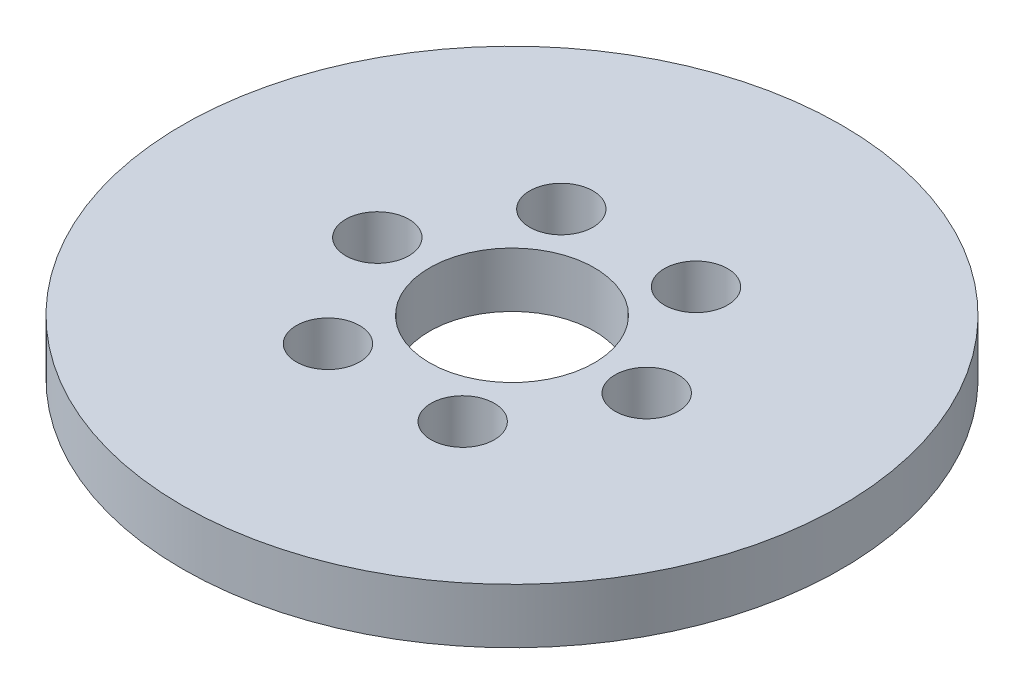
ISO-10303-21;
HEADER;
FILE_DESCRIPTION(('STEP AP214'),'2;1');
FILE_NAME('part.step','',(''),(''),'','','');
FILE_SCHEMA(('AUTOMOTIVE_DESIGN { 1 0 10303 214 1 1 1 1 }'));
ENDSEC;
DATA;
#1=APPLICATION_CONTEXT('core data for automotive mechanical design processes');
#2=APPLICATION_PROTOCOL_DEFINITION('international standard','automotive_design',2000,#1);
#3=PRODUCT_CONTEXT('',#1,'mechanical');
#4=PRODUCT('Part','Part','',(#3));
#5=PRODUCT_RELATED_PRODUCT_CATEGORY('part','',(#4));
#6=PRODUCT_DEFINITION_FORMATION('','',#4);
#7=PRODUCT_DEFINITION_CONTEXT('part definition',#1,'design');
#8=PRODUCT_DEFINITION('design','',#6,#7);
#9=PRODUCT_DEFINITION_SHAPE('','',#8);
#10=(LENGTH_UNIT() NAMED_UNIT(*) SI_UNIT(.MILLI.,.METRE.));
#11=(NAMED_UNIT(*) PLANE_ANGLE_UNIT() SI_UNIT($,.RADIAN.));
#12=(NAMED_UNIT(*) SI_UNIT($,.STERADIAN.) SOLID_ANGLE_UNIT());
#13=UNCERTAINTY_MEASURE_WITH_UNIT(LENGTH_MEASURE(1.E-05),#10,'distance_accuracy_value','');
#14=(GEOMETRIC_REPRESENTATION_CONTEXT(3) GLOBAL_UNCERTAINTY_ASSIGNED_CONTEXT((#13)) GLOBAL_UNIT_ASSIGNED_CONTEXT((#10,
#11,#12)) REPRESENTATION_CONTEXT('',''));
#15=CARTESIAN_POINT('',(0.,0.,0.));
#16=DIRECTION('',(0.,0.,1.));
#17=DIRECTION('',(1.,0.,0.));
#18=AXIS2_PLACEMENT_3D('',#15,#16,#17);
#19=CARTESIAN_POINT('',(0.,10.,0.));
#20=DIRECTION('',(0.,-1.,0.));
#21=DIRECTION('',(0.,0.,-1.));
#22=AXIS2_PLACEMENT_3D('',#19,#20,#21);
#23=CYLINDRICAL_SURFACE('',#22,60.);
#24=CARTESIAN_POINT('',(0.,10.,0.));
#25=DIRECTION('',(0.,1.,0.));
#26=DIRECTION('',(0.,0.,1.));
#27=AXIS2_PLACEMENT_3D('',#24,#25,#26);
#28=CIRCLE('',#27,60.);
#29=CARTESIAN_POINT('',(0.,10.,60.));
#30=VERTEX_POINT('',#29);
#31=EDGE_CURVE('E10',#30,#30,#28,.T.);
#32=ORIENTED_EDGE('',*,*,#31,.F.);
#33=EDGE_LOOP('',(#32));
#34=FACE_BOUND('',#33,.T.);
#35=CARTESIAN_POINT('',(0.,0.,0.));
#36=DIRECTION('',(0.,1.,0.));
#37=DIRECTION('',(0.,0.,1.));
#38=AXIS2_PLACEMENT_3D('',#35,#36,#37);
#39=CIRCLE('',#38,60.);
#40=CARTESIAN_POINT('',(0.,0.,60.));
#41=VERTEX_POINT('',#40);
#42=EDGE_CURVE('E37',#41,#41,#39,.T.);
#43=ORIENTED_EDGE('',*,*,#42,.T.);
#44=EDGE_LOOP('',(#43));
#45=FACE_BOUND('',#44,.T.);
#46=ADVANCED_FACE('F40',(#34,#45),#23,.T.);
#47=CARTESIAN_POINT('',(0.,10.,0.));
#48=DIRECTION('',(0.,1.,0.));
#49=DIRECTION('',(0.,0.,1.));
#50=AXIS2_PLACEMENT_3D('',#47,#48,#49);
#51=PLANE('',#50);
#52=CARTESIAN_POINT('',(-12.262471475754,10.,-21.2392236223694));
#53=DIRECTION('',(0.,1.,0.));
#54=DIRECTION('',(-0.866025403784433,0.,0.50000000000001));
#55=AXIS2_PLACEMENT_3D('',#52,#53,#54);
#56=CIRCLE('',#55,5.75771066863464);
#57=CARTESIAN_POINT('',(-17.2487951824322,10.,-18.360368288052));
#58=VERTEX_POINT('',#57);
#59=EDGE_CURVE('E70',#58,#58,#56,.T.);
#60=ORIENTED_EDGE('',*,*,#59,.F.);
#61=EDGE_LOOP('',(#60));
#62=FACE_BOUND('',#61,.T.);
#63=CARTESIAN_POINT('',(12.2624714757535,10.,-21.2392236223697));
#64=DIRECTION('',(0.,1.,0.));
#65=DIRECTION('',(-0.866025403784443,0.,-0.499999999999992));
#66=AXIS2_PLACEMENT_3D('',#63,#64,#65);
#67=CIRCLE('',#66,5.75771066863464);
#68=CARTESIAN_POINT('',(7.27614776907521,10.,-24.1180789566869));
#69=VERTEX_POINT('',#68);
#70=EDGE_CURVE('E71',#69,#69,#67,.T.);
#71=ORIENTED_EDGE('',*,*,#70,.F.);
#72=EDGE_LOOP('',(#71));
#73=FACE_BOUND('',#72,.T.);
#74=CARTESIAN_POINT('',(24.5249429515074,10.,0.));
#75=DIRECTION('',(0.,1.,0.));
#76=DIRECTION('',(0.,0.,-1.));
#77=AXIS2_PLACEMENT_3D('',#74,#75,#76);
#78=CIRCLE('',#77,5.75771066863464);
#79=CARTESIAN_POINT('',(24.5249429515074,10.,-5.75771066863464));
#80=VERTEX_POINT('',#79);
#81=EDGE_CURVE('E78',#80,#80,#78,.T.);
#82=ORIENTED_EDGE('',*,*,#81,.F.);
#83=EDGE_LOOP('',(#82));
#84=FACE_BOUND('',#83,.T.);
#85=CARTESIAN_POINT('',(12.2624714757538,10.,21.2392236223695));
#86=DIRECTION('',(0.,1.,0.));
#87=DIRECTION('',(0.866025403784436,0.,-0.500000000000004));
#88=AXIS2_PLACEMENT_3D('',#85,#86,#87);
#89=CIRCLE('',#88,5.75771066863464);
#90=CARTESIAN_POINT('',(17.2487951824321,10.,18.3603682880521));
#91=VERTEX_POINT('',#90);
#92=EDGE_CURVE('E84',#91,#91,#89,.T.);
#93=ORIENTED_EDGE('',*,*,#92,.F.);
#94=EDGE_LOOP('',(#93));
#95=FACE_BOUND('',#94,.T.);
#96=CARTESIAN_POINT('',(-12.2624714757537,10.,21.2392236223696));
#97=DIRECTION('',(0.,1.,0.));
#98=DIRECTION('',(0.86602540378444,0.,0.499999999999998));
#99=AXIS2_PLACEMENT_3D('',#96,#97,#98);
#100=CIRCLE('',#99,5.75771066863464);
#101=CARTESIAN_POINT('',(-7.27614776907538,10.,24.1180789566869));
#102=VERTEX_POINT('',#101);
#103=EDGE_CURVE('E61',#102,#102,#100,.T.);
#104=ORIENTED_EDGE('',*,*,#103,.F.);
#105=EDGE_LOOP('',(#104));
#106=FACE_BOUND('',#105,.T.);
#107=CARTESIAN_POINT('',(-24.5249429515074,10.,0.));
#108=DIRECTION('',(0.,1.,0.));
#109=DIRECTION('',(0.,0.,1.));
#110=AXIS2_PLACEMENT_3D('',#107,#108,#109);
#111=CIRCLE('',#110,5.75771066863464);
#112=CARTESIAN_POINT('',(-24.5249429515074,10.,5.75771066863464));
#113=VERTEX_POINT('',#112);
#114=EDGE_CURVE('E54',#113,#113,#111,.T.);
#115=ORIENTED_EDGE('',*,*,#114,.F.);
#116=EDGE_LOOP('',(#115));
#117=FACE_BOUND('',#116,.T.);
#118=CARTESIAN_POINT('',(0.,10.,0.));
#119=DIRECTION('',(0.,1.,0.));
#120=DIRECTION('',(0.,0.,1.));
#121=AXIS2_PLACEMENT_3D('',#118,#119,#120);
#122=CIRCLE('',#121,15.);
#123=CARTESIAN_POINT('',(0.,10.,15.));
#124=VERTEX_POINT('',#123);
#125=EDGE_CURVE('E50',#124,#124,#122,.T.);
#126=ORIENTED_EDGE('',*,*,#125,.F.);
#127=EDGE_LOOP('',(#126));
#128=FACE_BOUND('',#127,.T.);
#129=ORIENTED_EDGE('',*,*,#31,.T.);
#130=EDGE_LOOP('',(#129));
#131=FACE_BOUND('',#130,.T.);
#132=ADVANCED_FACE('F99',(#62,#73,#84,#95,#106,#117,#128,#131),#51,.T.);
#133=CARTESIAN_POINT('',(0.,0.,0.));
#134=DIRECTION('',(0.,1.,0.));
#135=DIRECTION('',(0.,0.,1.));
#136=AXIS2_PLACEMENT_3D('',#133,#134,#135);
#137=PLANE('',#136);
#138=CARTESIAN_POINT('',(0.,0.,0.));
#139=DIRECTION('',(0.,1.,0.));
#140=DIRECTION('',(0.,0.,1.));
#141=AXIS2_PLACEMENT_3D('',#138,#139,#140);
#142=CIRCLE('',#141,15.);
#143=CARTESIAN_POINT('',(0.,0.,15.));
#144=VERTEX_POINT('',#143);
#145=EDGE_CURVE('E47',#144,#144,#142,.T.);
#146=ORIENTED_EDGE('',*,*,#145,.T.);
#147=EDGE_LOOP('',(#146));
#148=FACE_BOUND('',#147,.T.);
#149=ORIENTED_EDGE('',*,*,#42,.F.);
#150=EDGE_LOOP('',(#149));
#151=FACE_BOUND('',#150,.T.);
#152=ADVANCED_FACE('F103',(#148,#151),#137,.F.);
#153=CARTESIAN_POINT('',(0.,10.,0.));
#154=DIRECTION('',(0.,-1.,0.));
#155=DIRECTION('',(0.,0.,-1.));
#156=AXIS2_PLACEMENT_3D('',#153,#154,#155);
#157=CYLINDRICAL_SURFACE('',#156,15.);
#158=ORIENTED_EDGE('',*,*,#125,.T.);
#159=EDGE_LOOP('',(#158));
#160=FACE_BOUND('',#159,.T.);
#161=ORIENTED_EDGE('',*,*,#145,.F.);
#162=EDGE_LOOP('',(#161));
#163=FACE_BOUND('',#162,.T.);
#164=ADVANCED_FACE('F115',(#160,#163),#157,.F.);
#165=CARTESIAN_POINT('',(-24.5249429515074,1.22633793782889,0.));
#166=DIRECTION('',(0.,1.,0.));
#167=DIRECTION('',(0.,0.,1.));
#168=AXIS2_PLACEMENT_3D('',#165,#166,#167);
#169=CYLINDRICAL_SURFACE('',#168,5.75771066863464);
#170=CARTESIAN_POINT('',(-24.5249429515074,1.22633793782889,0.));
#171=DIRECTION('',(0.,1.,0.));
#172=DIRECTION('',(0.,0.,1.));
#173=AXIS2_PLACEMENT_3D('',#170,#171,#172);
#174=CIRCLE('',#173,5.75771066863464);
#175=CARTESIAN_POINT('',(-24.5249429515074,1.22633793782889,5.75771066863464));
#176=VERTEX_POINT('',#175);
#177=EDGE_CURVE('E55',#176,#176,#174,.T.);
#178=ORIENTED_EDGE('',*,*,#177,.F.);
#179=EDGE_LOOP('',(#178));
#180=FACE_BOUND('',#179,.T.);
#181=ORIENTED_EDGE('',*,*,#114,.T.);
#182=EDGE_LOOP('',(#181));
#183=FACE_BOUND('',#182,.T.);
#184=ADVANCED_FACE('F113',(#180,#183),#169,.F.);
#185=CARTESIAN_POINT('',(-24.5249429515074,1.22633793782889,0.));
#186=DIRECTION('',(0.,1.,0.));
#187=DIRECTION('',(0.,0.,1.));
#188=AXIS2_PLACEMENT_3D('',#185,#186,#187);
#189=PLANE('',#188);
#190=ORIENTED_EDGE('',*,*,#177,.T.);
#191=EDGE_LOOP('',(#190));
#192=FACE_BOUND('',#191,.T.);
#193=ADVANCED_FACE('F144',(#192),#189,.T.);
#194=CARTESIAN_POINT('',(-12.2624714757537,1.22633793782889,21.2392236223696));
#195=DIRECTION('',(0.,1.,0.));
#196=DIRECTION('',(0.,0.,1.));
#197=AXIS2_PLACEMENT_3D('',#194,#195,#196);
#198=CYLINDRICAL_SURFACE('',#197,5.75771066863464);
#199=CARTESIAN_POINT('',(-12.2624714757537,1.22633793782889,21.2392236223696));
#200=DIRECTION('',(0.,1.,0.));
#201=DIRECTION('',(0.86602540378444,0.,0.499999999999998));
#202=AXIS2_PLACEMENT_3D('',#199,#200,#201);
#203=CIRCLE('',#202,5.75771066863464);
#204=CARTESIAN_POINT('',(-7.27614776907538,1.22633793782889,24.1180789566869));
#205=VERTEX_POINT('',#204);
#206=EDGE_CURVE('E59',#205,#205,#203,.T.);
#207=ORIENTED_EDGE('',*,*,#206,.F.);
#208=EDGE_LOOP('',(#207));
#209=FACE_BOUND('',#208,.T.);
#210=ORIENTED_EDGE('',*,*,#103,.T.);
#211=EDGE_LOOP('',(#210));
#212=FACE_BOUND('',#211,.T.);
#213=ADVANCED_FACE('F153',(#209,#212),#198,.F.);
#214=CARTESIAN_POINT('',(-12.2624714757537,1.22633793782889,21.2392236223696));
#215=DIRECTION('',(0.,1.,0.));
#216=DIRECTION('',(0.86602540378444,0.,0.499999999999998));
#217=AXIS2_PLACEMENT_3D('',#214,#215,#216);
#218=PLANE('',#217);
#219=ORIENTED_EDGE('',*,*,#206,.T.);
#220=EDGE_LOOP('',(#219));
#221=FACE_BOUND('',#220,.T.);
#222=ADVANCED_FACE('F96',(#221),#218,.T.);
#223=CARTESIAN_POINT('',(12.2624714757538,1.22633793782889,21.2392236223695));
#224=DIRECTION('',(0.,1.,0.));
#225=DIRECTION('',(0.,0.,1.));
#226=AXIS2_PLACEMENT_3D('',#223,#224,#225);
#227=CYLINDRICAL_SURFACE('',#226,5.75771066863464);
#228=CARTESIAN_POINT('',(12.2624714757538,1.22633793782889,21.2392236223695));
#229=DIRECTION('',(0.,1.,0.));
#230=DIRECTION('',(0.866025403784436,0.,-0.500000000000004));
#231=AXIS2_PLACEMENT_3D('',#228,#229,#230);
#232=CIRCLE('',#231,5.75771066863464);
#233=CARTESIAN_POINT('',(17.2487951824321,1.22633793782889,18.3603682880521));
#234=VERTEX_POINT('',#233);
#235=EDGE_CURVE('E63',#234,#234,#232,.T.);
#236=ORIENTED_EDGE('',*,*,#235,.F.);
#237=EDGE_LOOP('',(#236));
#238=FACE_BOUND('',#237,.T.);
#239=ORIENTED_EDGE('',*,*,#92,.T.);
#240=EDGE_LOOP('',(#239));
#241=FACE_BOUND('',#240,.T.);
#242=ADVANCED_FACE('F91',(#238,#241),#227,.F.);
#243=CARTESIAN_POINT('',(12.2624714757538,1.22633793782889,21.2392236223695));
#244=DIRECTION('',(0.,1.,0.));
#245=DIRECTION('',(0.866025403784436,0.,-0.500000000000004));
#246=AXIS2_PLACEMENT_3D('',#243,#244,#245);
#247=PLANE('',#246);
#248=ORIENTED_EDGE('',*,*,#235,.T.);
#249=EDGE_LOOP('',(#248));
#250=FACE_BOUND('',#249,.T.);
#251=ADVANCED_FACE('F93',(#250),#247,.T.);
#252=CARTESIAN_POINT('',(24.5249429515074,1.22633793782889,0.));
#253=DIRECTION('',(0.,1.,0.));
#254=DIRECTION('',(0.,0.,1.));
#255=AXIS2_PLACEMENT_3D('',#252,#253,#254);
#256=CYLINDRICAL_SURFACE('',#255,5.75771066863464);
#257=CARTESIAN_POINT('',(24.5249429515074,1.22633793782889,0.));
#258=DIRECTION('',(0.,1.,0.));
#259=DIRECTION('',(0.,0.,-1.));
#260=AXIS2_PLACEMENT_3D('',#257,#258,#259);
#261=CIRCLE('',#260,5.75771066863464);
#262=CARTESIAN_POINT('',(24.5249429515074,1.22633793782889,-5.75771066863464));
#263=VERTEX_POINT('',#262);
#264=EDGE_CURVE('E85',#263,#263,#261,.T.);
#265=ORIENTED_EDGE('',*,*,#264,.F.);
#266=EDGE_LOOP('',(#265));
#267=FACE_BOUND('',#266,.T.);
#268=ORIENTED_EDGE('',*,*,#81,.T.);
#269=EDGE_LOOP('',(#268));
#270=FACE_BOUND('',#269,.T.);
#271=ADVANCED_FACE('F187',(#267,#270),#256,.F.);
#272=CARTESIAN_POINT('',(24.5249429515074,1.22633793782889,0.));
#273=DIRECTION('',(0.,1.,0.));
#274=DIRECTION('',(0.,0.,-1.));
#275=AXIS2_PLACEMENT_3D('',#272,#273,#274);
#276=PLANE('',#275);
#277=ORIENTED_EDGE('',*,*,#264,.T.);
#278=EDGE_LOOP('',(#277));
#279=FACE_BOUND('',#278,.T.);
#280=ADVANCED_FACE('F198',(#279),#276,.T.);
#281=CARTESIAN_POINT('',(12.2624714757535,1.22633793782889,-21.2392236223697));
#282=DIRECTION('',(0.,1.,0.));
#283=DIRECTION('',(0.,0.,1.));
#284=AXIS2_PLACEMENT_3D('',#281,#282,#283);
#285=CYLINDRICAL_SURFACE('',#284,5.75771066863464);
#286=CARTESIAN_POINT('',(12.2624714757535,1.22633793782889,-21.2392236223697));
#287=DIRECTION('',(0.,1.,0.));
#288=DIRECTION('',(-0.866025403784443,0.,-0.499999999999992));
#289=AXIS2_PLACEMENT_3D('',#286,#287,#288);
#290=CIRCLE('',#289,5.75771066863464);
#291=CARTESIAN_POINT('',(7.27614776907521,1.22633793782889,-24.1180789566869));
#292=VERTEX_POINT('',#291);
#293=EDGE_CURVE('E76',#292,#292,#290,.T.);
#294=ORIENTED_EDGE('',*,*,#293,.F.);
#295=EDGE_LOOP('',(#294));
#296=FACE_BOUND('',#295,.T.);
#297=ORIENTED_EDGE('',*,*,#70,.T.);
#298=EDGE_LOOP('',(#297));
#299=FACE_BOUND('',#298,.T.);
#300=ADVANCED_FACE('F202',(#296,#299),#285,.F.);
#301=CARTESIAN_POINT('',(12.2624714757535,1.22633793782889,-21.2392236223697));
#302=DIRECTION('',(0.,1.,0.));
#303=DIRECTION('',(-0.866025403784443,0.,-0.499999999999992));
#304=AXIS2_PLACEMENT_3D('',#301,#302,#303);
#305=PLANE('',#304);
#306=ORIENTED_EDGE('',*,*,#293,.T.);
#307=EDGE_LOOP('',(#306));
#308=FACE_BOUND('',#307,.T.);
#309=ADVANCED_FACE('F212',(#308),#305,.T.);
#310=CARTESIAN_POINT('',(-12.262471475754,1.22633793782889,-21.2392236223694));
#311=DIRECTION('',(0.,1.,0.));
#312=DIRECTION('',(0.,0.,1.));
#313=AXIS2_PLACEMENT_3D('',#310,#311,#312);
#314=CYLINDRICAL_SURFACE('',#313,5.75771066863464);
#315=CARTESIAN_POINT('',(-12.262471475754,1.22633793782889,-21.2392236223694));
#316=DIRECTION('',(0.,1.,0.));
#317=DIRECTION('',(-0.866025403784433,0.,0.50000000000001));
#318=AXIS2_PLACEMENT_3D('',#315,#316,#317);
#319=CIRCLE('',#318,5.75771066863464);
#320=CARTESIAN_POINT('',(-17.2487951824322,1.22633793782889,-18.360368288052));
#321=VERTEX_POINT('',#320);
#322=EDGE_CURVE('E69',#321,#321,#319,.T.);
#323=ORIENTED_EDGE('',*,*,#322,.F.);
#324=EDGE_LOOP('',(#323));
#325=FACE_BOUND('',#324,.T.);
#326=ORIENTED_EDGE('',*,*,#59,.T.);
#327=EDGE_LOOP('',(#326));
#328=FACE_BOUND('',#327,.T.);
#329=ADVANCED_FACE('F224',(#325,#328),#314,.F.);
#330=CARTESIAN_POINT('',(-12.262471475754,1.22633793782889,-21.2392236223694));
#331=DIRECTION('',(0.,1.,0.));
#332=DIRECTION('',(-0.866025403784433,0.,0.50000000000001));
#333=AXIS2_PLACEMENT_3D('',#330,#331,#332);
#334=PLANE('',#333);
#335=ORIENTED_EDGE('',*,*,#322,.T.);
#336=EDGE_LOOP('',(#335));
#337=FACE_BOUND('',#336,.T.);
#338=ADVANCED_FACE('F235',(#337),#334,.T.);
#339=CLOSED_SHELL('',(#46,#132,#152,#164,#184,#193,#213,#222,#242,#251,#271,#280,#300,#309,#329,#338));
#340=MANIFOLD_SOLID_BREP('B2',#339);
#341=ADVANCED_BREP_SHAPE_REPRESENTATION('',(#18,#340),#14);
#342=SHAPE_DEFINITION_REPRESENTATION(#9,#341);
ENDSEC;
END-ISO-10303-21;
